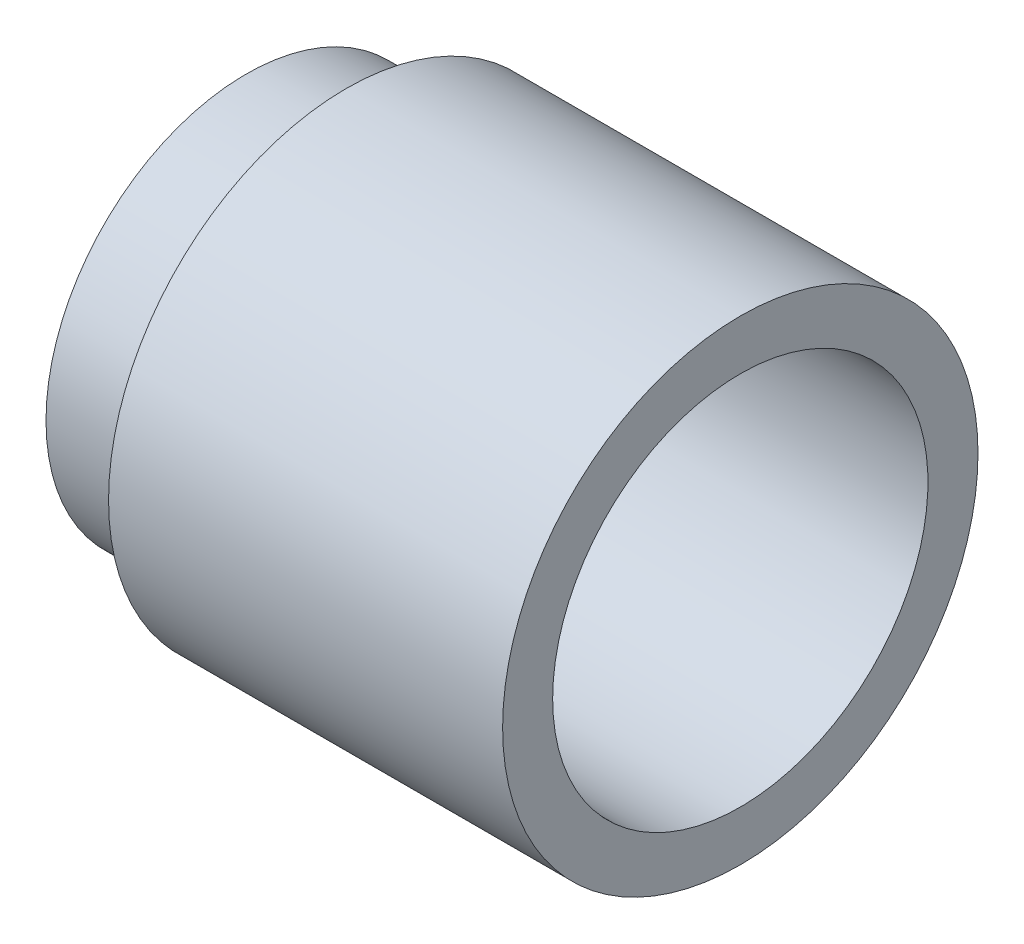
ISO-10303-21;
HEADER;
FILE_DESCRIPTION(('STEP AP214'),'2;1');
FILE_NAME('part.step','',(''),(''),'','','');
FILE_SCHEMA(('AUTOMOTIVE_DESIGN { 1 0 10303 214 1 1 1 1 }'));
ENDSEC;
DATA;
#1=APPLICATION_CONTEXT('core data for automotive mechanical design processes');
#2=APPLICATION_PROTOCOL_DEFINITION('international standard','automotive_design',2000,#1);
#3=PRODUCT_CONTEXT('',#1,'mechanical');
#4=PRODUCT('Part','Part','',(#3));
#5=PRODUCT_RELATED_PRODUCT_CATEGORY('part','',(#4));
#6=PRODUCT_DEFINITION_FORMATION('','',#4);
#7=PRODUCT_DEFINITION_CONTEXT('part definition',#1,'design');
#8=PRODUCT_DEFINITION('design','',#6,#7);
#9=PRODUCT_DEFINITION_SHAPE('','',#8);
#10=(LENGTH_UNIT() NAMED_UNIT(*) SI_UNIT(.MILLI.,.METRE.));
#11=(NAMED_UNIT(*) PLANE_ANGLE_UNIT() SI_UNIT($,.RADIAN.));
#12=(NAMED_UNIT(*) SI_UNIT($,.STERADIAN.) SOLID_ANGLE_UNIT());
#13=UNCERTAINTY_MEASURE_WITH_UNIT(LENGTH_MEASURE(1.E-05),#10,'distance_accuracy_value','');
#14=(GEOMETRIC_REPRESENTATION_CONTEXT(3) GLOBAL_UNCERTAINTY_ASSIGNED_CONTEXT((#13)) GLOBAL_UNIT_ASSIGNED_CONTEXT((#10,
#11,#12)) REPRESENTATION_CONTEXT('',''));
#15=CARTESIAN_POINT('',(0.,0.,0.));
#16=DIRECTION('',(0.,0.,1.));
#17=DIRECTION('',(1.,0.,0.));
#18=AXIS2_PLACEMENT_3D('',#15,#16,#17);
#19=CARTESIAN_POINT('',(4.,9.5,0.));
#20=DIRECTION('',(1.,0.,0.));
#21=DIRECTION('',(0.,0.,-1.));
#22=AXIS2_PLACEMENT_3D('',#19,#20,#21);
#23=PLANE('',#22);
#24=CARTESIAN_POINT('',(4.,0.,0.));
#25=DIRECTION('',(-1.,0.,0.));
#26=DIRECTION('',(0.,0.,1.));
#27=AXIS2_PLACEMENT_3D('',#24,#25,#26);
#28=CIRCLE('',#27,8.);
#29=CARTESIAN_POINT('',(4.,0.,8.));
#30=VERTEX_POINT('',#29);
#31=EDGE_CURVE('E53',#30,#30,#28,.T.);
#32=ORIENTED_EDGE('',*,*,#31,.F.);
#33=EDGE_LOOP('',(#32));
#34=FACE_BOUND('',#33,.T.);
#35=CARTESIAN_POINT('',(4.,0.,0.));
#36=DIRECTION('',(-1.,0.,0.));
#37=DIRECTION('',(0.,0.,1.));
#38=AXIS2_PLACEMENT_3D('',#35,#36,#37);
#39=CIRCLE('',#38,9.5);
#40=CARTESIAN_POINT('',(4.,0.,9.5));
#41=VERTEX_POINT('',#40);
#42=EDGE_CURVE('E10',#41,#41,#39,.T.);
#43=ORIENTED_EDGE('',*,*,#42,.T.);
#44=EDGE_LOOP('',(#43));
#45=FACE_BOUND('',#44,.T.);
#46=ADVANCED_FACE('F31',(#34,#45),#23,.F.);
#47=CARTESIAN_POINT('',(0.,0.,0.));
#48=DIRECTION('',(-1.,0.,0.));
#49=DIRECTION('',(0.,0.,1.));
#50=AXIS2_PLACEMENT_3D('',#47,#48,#49);
#51=CYLINDRICAL_SURFACE('',#50,9.5);
#52=ORIENTED_EDGE('',*,*,#42,.F.);
#53=EDGE_LOOP('',(#52));
#54=FACE_BOUND('',#53,.T.);
#55=CARTESIAN_POINT('',(19.75,0.,0.));
#56=DIRECTION('',(-1.,0.,0.));
#57=DIRECTION('',(0.,0.,1.));
#58=AXIS2_PLACEMENT_3D('',#55,#56,#57);
#59=CIRCLE('',#58,9.5);
#60=CARTESIAN_POINT('',(19.75,0.,9.5));
#61=VERTEX_POINT('',#60);
#62=EDGE_CURVE('E37',#61,#61,#59,.T.);
#63=ORIENTED_EDGE('',*,*,#62,.T.);
#64=EDGE_LOOP('',(#63));
#65=FACE_BOUND('',#64,.T.);
#66=ADVANCED_FACE('F60',(#54,#65),#51,.T.);
#67=CARTESIAN_POINT('',(19.75,7.5,0.));
#68=DIRECTION('',(-1.,0.,0.));
#69=DIRECTION('',(0.,0.,1.));
#70=AXIS2_PLACEMENT_3D('',#67,#68,#69);
#71=PLANE('',#70);
#72=ORIENTED_EDGE('',*,*,#62,.F.);
#73=EDGE_LOOP('',(#72));
#74=FACE_BOUND('',#73,.T.);
#75=CARTESIAN_POINT('',(19.75,0.,0.));
#76=DIRECTION('',(-1.,0.,0.));
#77=DIRECTION('',(0.,0.,1.));
#78=AXIS2_PLACEMENT_3D('',#75,#76,#77);
#79=CIRCLE('',#78,7.5);
#80=CARTESIAN_POINT('',(19.75,0.,7.5));
#81=VERTEX_POINT('',#80);
#82=EDGE_CURVE('E41',#81,#81,#79,.T.);
#83=ORIENTED_EDGE('',*,*,#82,.T.);
#84=EDGE_LOOP('',(#83));
#85=FACE_BOUND('',#84,.T.);
#86=ADVANCED_FACE('F64',(#74,#85),#71,.F.);
#87=CARTESIAN_POINT('',(0.,0.,0.));
#88=DIRECTION('',(-1.,0.,0.));
#89=DIRECTION('',(0.,0.,1.));
#90=AXIS2_PLACEMENT_3D('',#87,#88,#89);
#91=CYLINDRICAL_SURFACE('',#90,7.5);
#92=ORIENTED_EDGE('',*,*,#82,.F.);
#93=EDGE_LOOP('',(#92));
#94=FACE_BOUND('',#93,.T.);
#95=CARTESIAN_POINT('',(0.,0.,0.));
#96=DIRECTION('',(-1.,0.,0.));
#97=DIRECTION('',(0.,0.,1.));
#98=AXIS2_PLACEMENT_3D('',#95,#96,#97);
#99=CIRCLE('',#98,7.5);
#100=CARTESIAN_POINT('',(0.,0.,7.5));
#101=VERTEX_POINT('',#100);
#102=EDGE_CURVE('E45',#101,#101,#99,.T.);
#103=ORIENTED_EDGE('',*,*,#102,.T.);
#104=EDGE_LOOP('',(#103));
#105=FACE_BOUND('',#104,.T.);
#106=ADVANCED_FACE('F69',(#94,#105),#91,.F.);
#107=CARTESIAN_POINT('',(0.,8.,0.));
#108=DIRECTION('',(1.,0.,0.));
#109=DIRECTION('',(0.,0.,-1.));
#110=AXIS2_PLACEMENT_3D('',#107,#108,#109);
#111=PLANE('',#110);
#112=ORIENTED_EDGE('',*,*,#102,.F.);
#113=EDGE_LOOP('',(#112));
#114=FACE_BOUND('',#113,.T.);
#115=CARTESIAN_POINT('',(0.,0.,0.));
#116=DIRECTION('',(-1.,0.,0.));
#117=DIRECTION('',(0.,0.,1.));
#118=AXIS2_PLACEMENT_3D('',#115,#116,#117);
#119=CIRCLE('',#118,8.);
#120=CARTESIAN_POINT('',(0.,0.,8.));
#121=VERTEX_POINT('',#120);
#122=EDGE_CURVE('E50',#121,#121,#119,.T.);
#123=ORIENTED_EDGE('',*,*,#122,.T.);
#124=EDGE_LOOP('',(#123));
#125=FACE_BOUND('',#124,.T.);
#126=ADVANCED_FACE('F75',(#114,#125),#111,.F.);
#127=CARTESIAN_POINT('',(0.,0.,0.));
#128=DIRECTION('',(-1.,0.,0.));
#129=DIRECTION('',(0.,0.,1.));
#130=AXIS2_PLACEMENT_3D('',#127,#128,#129);
#131=CYLINDRICAL_SURFACE('',#130,8.);
#132=ORIENTED_EDGE('',*,*,#122,.F.);
#133=EDGE_LOOP('',(#132));
#134=FACE_BOUND('',#133,.T.);
#135=ORIENTED_EDGE('',*,*,#31,.T.);
#136=EDGE_LOOP('',(#135));
#137=FACE_BOUND('',#136,.T.);
#138=ADVANCED_FACE('F57',(#134,#137),#131,.T.);
#139=CLOSED_SHELL('',(#46,#66,#86,#106,#126,#138));
#140=MANIFOLD_SOLID_BREP('B2',#139);
#141=ADVANCED_BREP_SHAPE_REPRESENTATION('',(#18,#140),#14);
#142=SHAPE_DEFINITION_REPRESENTATION(#9,#141);
ENDSEC;
END-ISO-10303-21;
